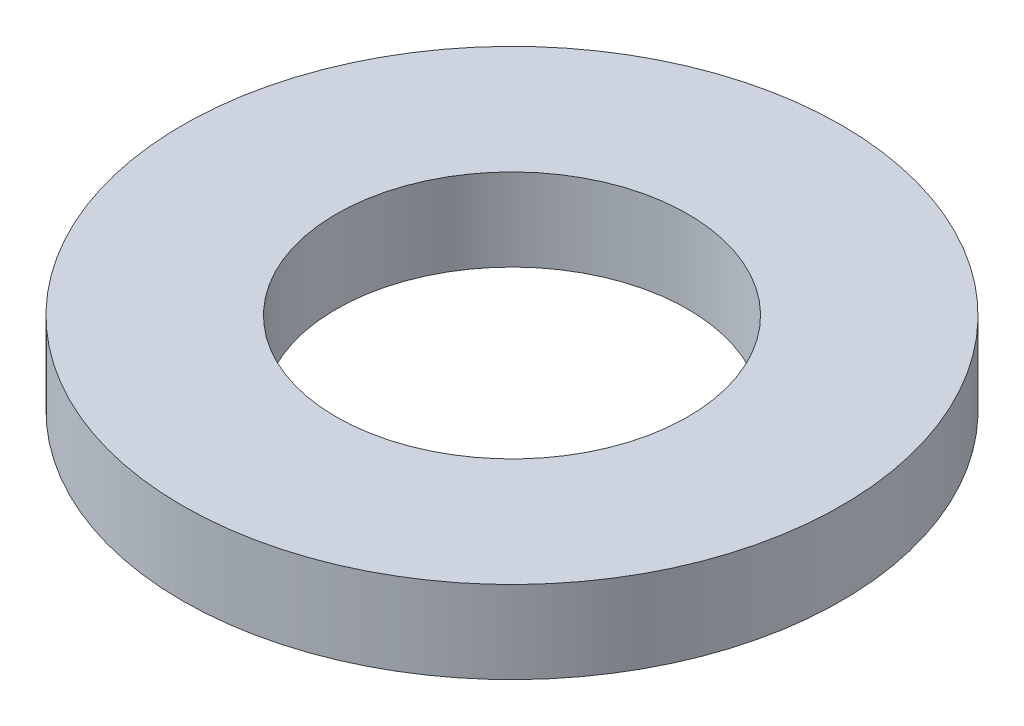
ISO-10303-21;
HEADER;
FILE_DESCRIPTION(('STEP AP214'),'2;1');
FILE_NAME('part.step','',(''),(''),'','','');
FILE_SCHEMA(('AUTOMOTIVE_DESIGN { 1 0 10303 214 1 1 1 1 }'));
ENDSEC;
DATA;
#1=APPLICATION_CONTEXT('core data for automotive mechanical design processes');
#2=APPLICATION_PROTOCOL_DEFINITION('international standard','automotive_design',2000,#1);
#3=PRODUCT_CONTEXT('',#1,'mechanical');
#4=PRODUCT('Part','Part','',(#3));
#5=PRODUCT_RELATED_PRODUCT_CATEGORY('part','',(#4));
#6=PRODUCT_DEFINITION_FORMATION('','',#4);
#7=PRODUCT_DEFINITION_CONTEXT('part definition',#1,'design');
#8=PRODUCT_DEFINITION('design','',#6,#7);
#9=PRODUCT_DEFINITION_SHAPE('','',#8);
#10=(LENGTH_UNIT() NAMED_UNIT(*) SI_UNIT(.MILLI.,.METRE.));
#11=(NAMED_UNIT(*) PLANE_ANGLE_UNIT() SI_UNIT($,.RADIAN.));
#12=(NAMED_UNIT(*) SI_UNIT($,.STERADIAN.) SOLID_ANGLE_UNIT());
#13=UNCERTAINTY_MEASURE_WITH_UNIT(LENGTH_MEASURE(1.E-05),#10,'distance_accuracy_value','');
#14=(GEOMETRIC_REPRESENTATION_CONTEXT(3) GLOBAL_UNCERTAINTY_ASSIGNED_CONTEXT((#13)) GLOBAL_UNIT_ASSIGNED_CONTEXT((#10,
#11,#12)) REPRESENTATION_CONTEXT('',''));
#15=CARTESIAN_POINT('',(0.,0.,0.));
#16=DIRECTION('',(0.,0.,1.));
#17=DIRECTION('',(1.,0.,0.));
#18=AXIS2_PLACEMENT_3D('',#15,#16,#17);
#19=CARTESIAN_POINT('',(0.,1.44651382856864,0.));
#20=DIRECTION('',(0.,1.,0.));
#21=DIRECTION('',(0.,0.,1.));
#22=AXIS2_PLACEMENT_3D('',#19,#20,#21);
#23=CYLINDRICAL_SURFACE('',#22,3.2);
#24=CARTESIAN_POINT('',(0.,-0.75,0.));
#25=DIRECTION('',(0.,1.,0.));
#26=DIRECTION('',(0.,0.,1.));
#27=AXIS2_PLACEMENT_3D('',#24,#25,#26);
#28=CIRCLE('',#27,3.2);
#29=CARTESIAN_POINT('',(0.,-0.75,3.2));
#30=VERTEX_POINT('',#29);
#31=EDGE_CURVE('E10',#30,#30,#28,.T.);
#32=ORIENTED_EDGE('',*,*,#31,.F.);
#33=EDGE_LOOP('',(#32));
#34=FACE_BOUND('',#33,.T.);
#35=CARTESIAN_POINT('',(0.,0.75,0.));
#36=DIRECTION('',(0.,1.,0.));
#37=DIRECTION('',(0.,0.,1.));
#38=AXIS2_PLACEMENT_3D('',#35,#36,#37);
#39=CIRCLE('',#38,3.2);
#40=CARTESIAN_POINT('',(0.,0.75,3.2));
#41=VERTEX_POINT('',#40);
#42=EDGE_CURVE('E43',#41,#41,#39,.T.);
#43=ORIENTED_EDGE('',*,*,#42,.T.);
#44=EDGE_LOOP('',(#43));
#45=FACE_BOUND('',#44,.T.);
#46=ADVANCED_FACE('F29',(#34,#45),#23,.F.);
#47=CARTESIAN_POINT('',(3.2,-0.75,0.));
#48=DIRECTION('',(0.,1.,0.));
#49=DIRECTION('',(0.,0.,1.));
#50=AXIS2_PLACEMENT_3D('',#47,#48,#49);
#51=PLANE('',#50);
#52=CARTESIAN_POINT('',(0.,-0.75,0.));
#53=DIRECTION('',(0.,1.,0.));
#54=DIRECTION('',(0.,0.,1.));
#55=AXIS2_PLACEMENT_3D('',#52,#53,#54);
#56=CIRCLE('',#55,6.);
#57=CARTESIAN_POINT('',(0.,-0.75,6.));
#58=VERTEX_POINT('',#57);
#59=EDGE_CURVE('E35',#58,#58,#56,.T.);
#60=ORIENTED_EDGE('',*,*,#59,.F.);
#61=EDGE_LOOP('',(#60));
#62=FACE_BOUND('',#61,.T.);
#63=ORIENTED_EDGE('',*,*,#31,.T.);
#64=EDGE_LOOP('',(#63));
#65=FACE_BOUND('',#64,.T.);
#66=ADVANCED_FACE('F58',(#62,#65),#51,.F.);
#67=CARTESIAN_POINT('',(0.,1.44651382856864,0.));
#68=DIRECTION('',(0.,1.,0.));
#69=DIRECTION('',(0.,0.,1.));
#70=AXIS2_PLACEMENT_3D('',#67,#68,#69);
#71=CYLINDRICAL_SURFACE('',#70,6.);
#72=CARTESIAN_POINT('',(0.,0.75,0.));
#73=DIRECTION('',(0.,1.,0.));
#74=DIRECTION('',(0.,0.,1.));
#75=AXIS2_PLACEMENT_3D('',#72,#73,#74);
#76=CIRCLE('',#75,6.);
#77=CARTESIAN_POINT('',(0.,0.75,6.));
#78=VERTEX_POINT('',#77);
#79=EDGE_CURVE('E39',#78,#78,#76,.T.);
#80=ORIENTED_EDGE('',*,*,#79,.F.);
#81=EDGE_LOOP('',(#80));
#82=FACE_BOUND('',#81,.T.);
#83=ORIENTED_EDGE('',*,*,#59,.T.);
#84=EDGE_LOOP('',(#83));
#85=FACE_BOUND('',#84,.T.);
#86=ADVANCED_FACE('F53',(#82,#85),#71,.T.);
#87=CARTESIAN_POINT('',(3.2,0.75,0.));
#88=DIRECTION('',(0.,-1.,0.));
#89=DIRECTION('',(0.,0.,-1.));
#90=AXIS2_PLACEMENT_3D('',#87,#88,#89);
#91=PLANE('',#90);
#92=ORIENTED_EDGE('',*,*,#42,.F.);
#93=EDGE_LOOP('',(#92));
#94=FACE_BOUND('',#93,.T.);
#95=ORIENTED_EDGE('',*,*,#79,.T.);
#96=EDGE_LOOP('',(#95));
#97=FACE_BOUND('',#96,.T.);
#98=ADVANCED_FACE('F50',(#94,#97),#91,.F.);
#99=CLOSED_SHELL('',(#46,#66,#86,#98));
#100=MANIFOLD_SOLID_BREP('B2',#99);
#101=ADVANCED_BREP_SHAPE_REPRESENTATION('',(#18,#100),#14);
#102=SHAPE_DEFINITION_REPRESENTATION(#9,#101);
ENDSEC;
END-ISO-10303-21;
